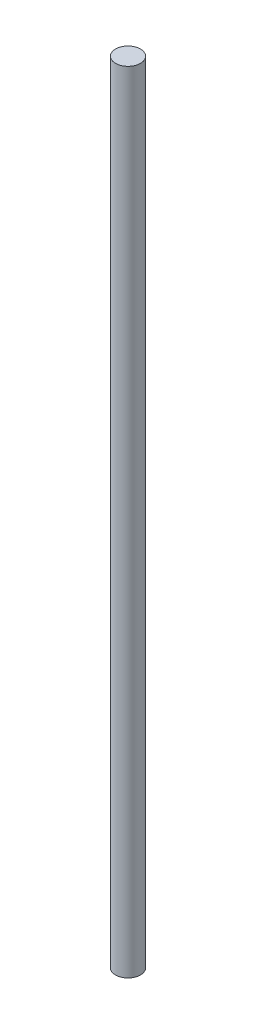
ISO-10303-21;
HEADER;
FILE_DESCRIPTION(('STEP AP214'),'2;1');
FILE_NAME('part.step','',(''),(''),'','','');
FILE_SCHEMA(('AUTOMOTIVE_DESIGN { 1 0 10303 214 1 1 1 1 }'));
ENDSEC;
DATA;
#1=APPLICATION_CONTEXT('core data for automotive mechanical design processes');
#2=APPLICATION_PROTOCOL_DEFINITION('international standard','automotive_design',2000,#1);
#3=PRODUCT_CONTEXT('',#1,'mechanical');
#4=PRODUCT('Part','Part','',(#3));
#5=PRODUCT_RELATED_PRODUCT_CATEGORY('part','',(#4));
#6=PRODUCT_DEFINITION_FORMATION('','',#4);
#7=PRODUCT_DEFINITION_CONTEXT('part definition',#1,'design');
#8=PRODUCT_DEFINITION('design','',#6,#7);
#9=PRODUCT_DEFINITION_SHAPE('','',#8);
#10=(LENGTH_UNIT() NAMED_UNIT(*) SI_UNIT(.MILLI.,.METRE.));
#11=(NAMED_UNIT(*) PLANE_ANGLE_UNIT() SI_UNIT($,.RADIAN.));
#12=(NAMED_UNIT(*) SI_UNIT($,.STERADIAN.) SOLID_ANGLE_UNIT());
#13=UNCERTAINTY_MEASURE_WITH_UNIT(LENGTH_MEASURE(1.E-05),#10,'distance_accuracy_value','');
#14=(GEOMETRIC_REPRESENTATION_CONTEXT(3) GLOBAL_UNCERTAINTY_ASSIGNED_CONTEXT((#13)) GLOBAL_UNIT_ASSIGNED_CONTEXT((#10,
#11,#12)) REPRESENTATION_CONTEXT('',''));
#15=CARTESIAN_POINT('',(0.,0.,0.));
#16=DIRECTION('',(0.,0.,1.));
#17=DIRECTION('',(1.,0.,0.));
#18=AXIS2_PLACEMENT_3D('',#15,#16,#17);
#19=CARTESIAN_POINT('',(0.,295.275,0.));
#20=DIRECTION('',(0.,-1.,0.));
#21=DIRECTION('',(0.,0.,-1.));
#22=AXIS2_PLACEMENT_3D('',#19,#20,#21);
#23=CYLINDRICAL_SURFACE('',#22,4.6609);
#24=CARTESIAN_POINT('',(0.,295.275,0.));
#25=DIRECTION('',(0.,1.,0.));
#26=DIRECTION('',(0.,0.,1.));
#27=AXIS2_PLACEMENT_3D('',#24,#25,#26);
#28=CIRCLE('',#27,4.6609);
#29=CARTESIAN_POINT('',(0.,295.275,4.6609));
#30=VERTEX_POINT('',#29);
#31=EDGE_CURVE('E10',#30,#30,#28,.T.);
#32=ORIENTED_EDGE('',*,*,#31,.F.);
#33=EDGE_LOOP('',(#32));
#34=FACE_BOUND('',#33,.T.);
#35=CARTESIAN_POINT('',(0.,0.,0.));
#36=DIRECTION('',(0.,1.,0.));
#37=DIRECTION('',(0.,0.,1.));
#38=AXIS2_PLACEMENT_3D('',#35,#36,#37);
#39=CIRCLE('',#38,4.6609);
#40=CARTESIAN_POINT('',(0.,0.,4.6609));
#41=VERTEX_POINT('',#40);
#42=EDGE_CURVE('E34',#41,#41,#39,.T.);
#43=ORIENTED_EDGE('',*,*,#42,.T.);
#44=EDGE_LOOP('',(#43));
#45=FACE_BOUND('',#44,.T.);
#46=ADVANCED_FACE('F31',(#34,#45),#23,.T.);
#47=CARTESIAN_POINT('',(0.,295.275,0.));
#48=DIRECTION('',(0.,1.,0.));
#49=DIRECTION('',(0.,0.,1.));
#50=AXIS2_PLACEMENT_3D('',#47,#48,#49);
#51=PLANE('',#50);
#52=ORIENTED_EDGE('',*,*,#31,.T.);
#53=EDGE_LOOP('',(#52));
#54=FACE_BOUND('',#53,.T.);
#55=ADVANCED_FACE('F46',(#54),#51,.T.);
#56=CARTESIAN_POINT('',(0.,0.,0.));
#57=DIRECTION('',(0.,1.,0.));
#58=DIRECTION('',(0.,0.,1.));
#59=AXIS2_PLACEMENT_3D('',#56,#57,#58);
#60=PLANE('',#59);
#61=ORIENTED_EDGE('',*,*,#42,.F.);
#62=EDGE_LOOP('',(#61));
#63=FACE_BOUND('',#62,.T.);
#64=ADVANCED_FACE('F44',(#63),#60,.F.);
#65=CLOSED_SHELL('',(#46,#55,#64));
#66=MANIFOLD_SOLID_BREP('B2',#65);
#67=ADVANCED_BREP_SHAPE_REPRESENTATION('',(#18,#66),#14);
#68=SHAPE_DEFINITION_REPRESENTATION(#9,#67);
ENDSEC;
END-ISO-10303-21;
